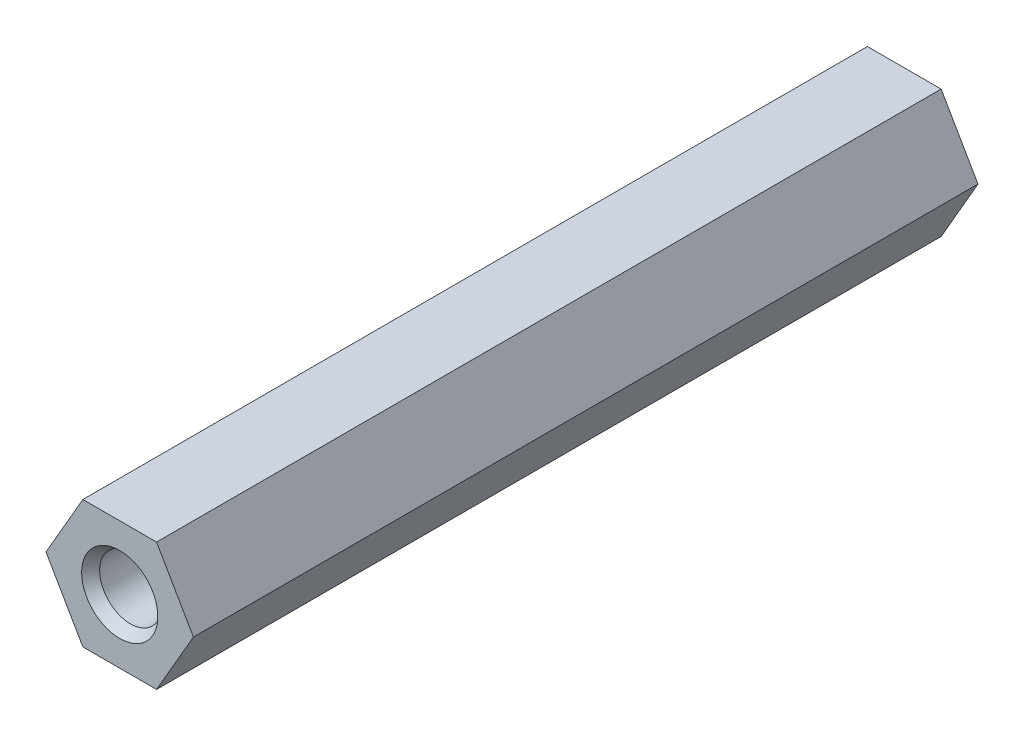
ISO-10303-21;
HEADER;
FILE_DESCRIPTION(('STEP AP214'),'2;1');
FILE_NAME('part.step','',(''),(''),'','','');
FILE_SCHEMA(('AUTOMOTIVE_DESIGN { 1 0 10303 214 1 1 1 1 }'));
ENDSEC;
DATA;
#1=APPLICATION_CONTEXT('core data for automotive mechanical design processes');
#2=APPLICATION_PROTOCOL_DEFINITION('international standard','automotive_design',2000,#1);
#3=PRODUCT_CONTEXT('',#1,'mechanical');
#4=PRODUCT('Part','Part','',(#3));
#5=PRODUCT_RELATED_PRODUCT_CATEGORY('part','',(#4));
#6=PRODUCT_DEFINITION_FORMATION('','',#4);
#7=PRODUCT_DEFINITION_CONTEXT('part definition',#1,'design');
#8=PRODUCT_DEFINITION('design','',#6,#7);
#9=PRODUCT_DEFINITION_SHAPE('','',#8);
#10=(LENGTH_UNIT() NAMED_UNIT(*) SI_UNIT(.MILLI.,.METRE.));
#11=(NAMED_UNIT(*) PLANE_ANGLE_UNIT() SI_UNIT($,.RADIAN.));
#12=(NAMED_UNIT(*) SI_UNIT($,.STERADIAN.) SOLID_ANGLE_UNIT());
#13=UNCERTAINTY_MEASURE_WITH_UNIT(LENGTH_MEASURE(1.E-05),#10,'distance_accuracy_value','');
#14=(GEOMETRIC_REPRESENTATION_CONTEXT(3) GLOBAL_UNCERTAINTY_ASSIGNED_CONTEXT((#13)) GLOBAL_UNIT_ASSIGNED_CONTEXT((#10,
#11,#12)) REPRESENTATION_CONTEXT('',''));
#15=CARTESIAN_POINT('',(0.,0.,0.));
#16=DIRECTION('',(0.,0.,1.));
#17=DIRECTION('',(1.,0.,0.));
#18=AXIS2_PLACEMENT_3D('',#15,#16,#17);
#19=CARTESIAN_POINT('',(-1.78978583448784,-3.1,-6.34999999995089));
#20=DIRECTION('',(0.,-1.,0.));
#21=DIRECTION('',(0.,0.,-1.));
#22=AXIS2_PLACEMENT_3D('',#19,#20,#21);
#23=PLANE('',#22);
#24=DIRECTION('',(0.,0.,1.));
#25=VECTOR('',#24,1.);
#26=CARTESIAN_POINT('',(-1.78978583448784,-3.1,-6.34999999995089));
#27=LINE('',#26,#25);
#28=CARTESIAN_POINT('',(-1.78978583448784,-3.1,-6.34999999995089));
#29=VERTEX_POINT('',#28);
#30=CARTESIAN_POINT('',(-1.78978583448784,-3.1,31.7500000000491));
#31=VERTEX_POINT('',#30);
#32=EDGE_CURVE('E87',#29,#31,#27,.T.);
#33=ORIENTED_EDGE('',*,*,#32,.F.);
#34=DIRECTION('',(1.,0.,0.));
#35=VECTOR('',#34,1.);
#36=CARTESIAN_POINT('',(0.,-3.1,-6.34999999995089));
#37=LINE('',#36,#35);
#38=CARTESIAN_POINT('',(1.78978583448784,-3.1,-6.34999999995089));
#39=VERTEX_POINT('',#38);
#40=EDGE_CURVE('E111',#29,#39,#37,.T.);
#41=ORIENTED_EDGE('',*,*,#40,.T.);
#42=DIRECTION('',(0.,0.,1.));
#43=VECTOR('',#42,1.);
#44=CARTESIAN_POINT('',(1.78978583448784,-3.1,-6.34999999995089));
#45=LINE('',#44,#43);
#46=CARTESIAN_POINT('',(1.78978583448784,-3.1,31.7500000000491));
#47=VERTEX_POINT('',#46);
#48=EDGE_CURVE('E185',#47,#39,#45,.F.);
#49=ORIENTED_EDGE('',*,*,#48,.F.);
#50=DIRECTION('',(1.,0.,0.));
#51=VECTOR('',#50,1.);
#52=CARTESIAN_POINT('',(0.,-3.1,31.7500000000491));
#53=LINE('',#52,#51);
#54=EDGE_CURVE('E109',#31,#47,#53,.T.);
#55=ORIENTED_EDGE('',*,*,#54,.F.);
#56=EDGE_LOOP('',(#33,#41,#49,#55));
#57=FACE_BOUND('',#56,.T.);
#58=ADVANCED_FACE('F38',(#57),#23,.T.);
#59=CARTESIAN_POINT('',(1.78978583448784,-3.1,-6.34999999995089));
#60=DIRECTION('',(0.866025403784439,-0.5,0.));
#61=DIRECTION('',(0.5,0.866025403784439,0.));
#62=AXIS2_PLACEMENT_3D('',#59,#60,#61);
#63=PLANE('',#62);
#64=ORIENTED_EDGE('',*,*,#48,.T.);
#65=DIRECTION('',(0.5,0.866025403784439,0.));
#66=VECTOR('',#65,1.);
#67=CARTESIAN_POINT('',(1.78978583448784,-3.1,-6.34999999995089));
#68=LINE('',#67,#66);
#69=CARTESIAN_POINT('',(3.57957166897568,0.,-6.34999999995089));
#70=VERTEX_POINT('',#69);
#71=EDGE_CURVE('E182',#39,#70,#68,.T.);
#72=ORIENTED_EDGE('',*,*,#71,.T.);
#73=DIRECTION('',(0.,0.,1.));
#74=VECTOR('',#73,1.);
#75=CARTESIAN_POINT('',(3.57957166897568,0.,-6.34999999995089));
#76=LINE('',#75,#74);
#77=CARTESIAN_POINT('',(3.57957166897568,0.,31.7500000000491));
#78=VERTEX_POINT('',#77);
#79=EDGE_CURVE('E179',#78,#70,#76,.F.);
#80=ORIENTED_EDGE('',*,*,#79,.F.);
#81=DIRECTION('',(0.5,0.866025403784439,0.));
#82=VECTOR('',#81,1.);
#83=CARTESIAN_POINT('',(1.78978583448784,-3.1,31.7500000000491));
#84=LINE('',#83,#82);
#85=EDGE_CURVE('E106',#47,#78,#84,.T.);
#86=ORIENTED_EDGE('',*,*,#85,.F.);
#87=EDGE_LOOP('',(#64,#72,#80,#86));
#88=FACE_BOUND('',#87,.T.);
#89=ADVANCED_FACE('F155',(#88),#63,.T.);
#90=CARTESIAN_POINT('',(3.57957166897568,0.,-6.34999999995089));
#91=DIRECTION('',(0.866025403784439,0.5,0.));
#92=DIRECTION('',(-0.5,0.866025403784439,0.));
#93=AXIS2_PLACEMENT_3D('',#90,#91,#92);
#94=PLANE('',#93);
#95=ORIENTED_EDGE('',*,*,#79,.T.);
#96=DIRECTION('',(-0.5,0.866025403784438,0.));
#97=VECTOR('',#96,1.);
#98=CARTESIAN_POINT('',(3.57957166897568,0.,-6.34999999995089));
#99=LINE('',#98,#97);
#100=CARTESIAN_POINT('',(1.78978583448784,3.1,-6.34999999995089));
#101=VERTEX_POINT('',#100);
#102=EDGE_CURVE('E170',#70,#101,#99,.T.);
#103=ORIENTED_EDGE('',*,*,#102,.T.);
#104=DIRECTION('',(0.,0.,1.));
#105=VECTOR('',#104,1.);
#106=CARTESIAN_POINT('',(1.78978583448784,3.1,-6.34999999995089));
#107=LINE('',#106,#105);
#108=CARTESIAN_POINT('',(1.78978583448784,3.1,31.7500000000491));
#109=VERTEX_POINT('',#108);
#110=EDGE_CURVE('E175',#109,#101,#107,.F.);
#111=ORIENTED_EDGE('',*,*,#110,.F.);
#112=DIRECTION('',(-0.5,0.866025403784438,0.));
#113=VECTOR('',#112,1.);
#114=CARTESIAN_POINT('',(3.57957166897568,0.,31.7500000000491));
#115=LINE('',#114,#113);
#116=EDGE_CURVE('E174',#78,#109,#115,.T.);
#117=ORIENTED_EDGE('',*,*,#116,.F.);
#118=EDGE_LOOP('',(#95,#103,#111,#117));
#119=FACE_BOUND('',#118,.T.);
#120=ADVANCED_FACE('F151',(#119),#94,.T.);
#121=CARTESIAN_POINT('',(1.78978583448784,3.1,-6.34999999995089));
#122=DIRECTION('',(0.,1.,0.));
#123=DIRECTION('',(0.,0.,1.));
#124=AXIS2_PLACEMENT_3D('',#121,#122,#123);
#125=PLANE('',#124);
#126=ORIENTED_EDGE('',*,*,#110,.T.);
#127=DIRECTION('',(1.,0.,0.));
#128=VECTOR('',#127,1.);
#129=CARTESIAN_POINT('',(0.,3.1,-6.34999999995089));
#130=LINE('',#129,#128);
#131=CARTESIAN_POINT('',(-1.78978583448784,3.1,-6.34999999995089));
#132=VERTEX_POINT('',#131);
#133=EDGE_CURVE('E167',#101,#132,#130,.F.);
#134=ORIENTED_EDGE('',*,*,#133,.T.);
#135=DIRECTION('',(0.,0.,1.));
#136=VECTOR('',#135,1.);
#137=CARTESIAN_POINT('',(-1.78978583448784,3.1,-6.34999999995089));
#138=LINE('',#137,#136);
#139=CARTESIAN_POINT('',(-1.78978583448784,3.1,31.7500000000491));
#140=VERTEX_POINT('',#139);
#141=EDGE_CURVE('E165',#140,#132,#138,.F.);
#142=ORIENTED_EDGE('',*,*,#141,.F.);
#143=DIRECTION('',(1.,0.,0.));
#144=VECTOR('',#143,1.);
#145=CARTESIAN_POINT('',(0.,3.1,31.7500000000491));
#146=LINE('',#145,#144);
#147=EDGE_CURVE('E98',#109,#140,#146,.F.);
#148=ORIENTED_EDGE('',*,*,#147,.F.);
#149=EDGE_LOOP('',(#126,#134,#142,#148));
#150=FACE_BOUND('',#149,.T.);
#151=ADVANCED_FACE('F148',(#150),#125,.T.);
#152=CARTESIAN_POINT('',(-1.78978583448784,3.1,-6.34999999995089));
#153=DIRECTION('',(-0.866025403784439,0.5,0.));
#154=DIRECTION('',(-0.5,-0.866025403784439,0.));
#155=AXIS2_PLACEMENT_3D('',#152,#153,#154);
#156=PLANE('',#155);
#157=ORIENTED_EDGE('',*,*,#141,.T.);
#158=DIRECTION('',(-0.5,-0.866025403784439,0.));
#159=VECTOR('',#158,1.);
#160=CARTESIAN_POINT('',(-1.78978583448784,3.1,-6.34999999995089));
#161=LINE('',#160,#159);
#162=CARTESIAN_POINT('',(-3.57957166897568,0.,-6.34999999995089));
#163=VERTEX_POINT('',#162);
#164=EDGE_CURVE('E105',#132,#163,#161,.T.);
#165=ORIENTED_EDGE('',*,*,#164,.T.);
#166=DIRECTION('',(0.,0.,1.));
#167=VECTOR('',#166,1.);
#168=CARTESIAN_POINT('',(-3.57957166897568,0.,-6.34999999995089));
#169=LINE('',#168,#167);
#170=CARTESIAN_POINT('',(-3.57957166897568,0.,31.7500000000491));
#171=VERTEX_POINT('',#170);
#172=EDGE_CURVE('E55',#171,#163,#169,.F.);
#173=ORIENTED_EDGE('',*,*,#172,.F.);
#174=DIRECTION('',(-0.5,-0.866025403784439,0.));
#175=VECTOR('',#174,1.);
#176=CARTESIAN_POINT('',(-1.78978583448784,3.1,31.7500000000491));
#177=LINE('',#176,#175);
#178=EDGE_CURVE('E92',#140,#171,#177,.T.);
#179=ORIENTED_EDGE('',*,*,#178,.F.);
#180=EDGE_LOOP('',(#157,#165,#173,#179));
#181=FACE_BOUND('',#180,.T.);
#182=ADVANCED_FACE('F103',(#181),#156,.T.);
#183=CARTESIAN_POINT('',(-3.57957166897568,0.,-6.34999999995089));
#184=DIRECTION('',(-0.866025403784438,-0.5,0.));
#185=DIRECTION('',(0.5,-0.866025403784438,0.));
#186=AXIS2_PLACEMENT_3D('',#183,#184,#185);
#187=PLANE('',#186);
#188=ORIENTED_EDGE('',*,*,#172,.T.);
#189=DIRECTION('',(0.5,-0.866025403784439,0.));
#190=VECTOR('',#189,1.);
#191=CARTESIAN_POINT('',(-3.57957166897568,0.,-6.34999999995089));
#192=LINE('',#191,#190);
#193=EDGE_CURVE('E115',#163,#29,#192,.T.);
#194=ORIENTED_EDGE('',*,*,#193,.T.);
#195=ORIENTED_EDGE('',*,*,#32,.T.);
#196=DIRECTION('',(0.5,-0.866025403784439,0.));
#197=VECTOR('',#196,1.);
#198=CARTESIAN_POINT('',(-3.57957166897568,0.,31.7500000000491));
#199=LINE('',#198,#197);
#200=EDGE_CURVE('E95',#171,#31,#199,.T.);
#201=ORIENTED_EDGE('',*,*,#200,.F.);
#202=EDGE_LOOP('',(#188,#194,#195,#201));
#203=FACE_BOUND('',#202,.T.);
#204=ADVANCED_FACE('F108',(#203),#187,.T.);
#205=CARTESIAN_POINT('',(0.,0.,31.7500000000491));
#206=DIRECTION('',(0.,0.,1.));
#207=DIRECTION('',(1.,0.,0.));
#208=AXIS2_PLACEMENT_3D('',#205,#206,#207);
#209=PLANE('',#208);
#210=CARTESIAN_POINT('',(0.,0.,31.7499999971359));
#211=DIRECTION('',(0.,0.,-1.));
#212=DIRECTION('',(-1.,0.,0.));
#213=AXIS2_PLACEMENT_3D('',#210,#211,#212);
#214=CIRCLE('',#213,1.84999999805768);
#215=CARTESIAN_POINT('',(-1.84999999805768,0.,31.7499999971359));
#216=VERTEX_POINT('',#215);
#217=EDGE_CURVE('E116',#216,#216,#214,.T.);
#218=ORIENTED_EDGE('',*,*,#217,.T.);
#219=EDGE_LOOP('',(#218));
#220=FACE_BOUND('',#219,.T.);
#221=ORIENTED_EDGE('',*,*,#200,.T.);
#222=ORIENTED_EDGE('',*,*,#54,.T.);
#223=ORIENTED_EDGE('',*,*,#85,.T.);
#224=ORIENTED_EDGE('',*,*,#116,.T.);
#225=ORIENTED_EDGE('',*,*,#147,.T.);
#226=ORIENTED_EDGE('',*,*,#178,.T.);
#227=EDGE_LOOP('',(#221,#222,#223,#224,#225,#226));
#228=FACE_BOUND('',#227,.T.);
#229=ADVANCED_FACE('F93',(#220,#228),#209,.T.);
#230=CARTESIAN_POINT('',(0.,0.,-6.34999999995089));
#231=DIRECTION('',(0.,0.,1.));
#232=DIRECTION('',(1.,0.,0.));
#233=AXIS2_PLACEMENT_3D('',#230,#231,#232);
#234=PLANE('',#233);
#235=CARTESIAN_POINT('',(0.,0.,-6.34999999568764));
#236=DIRECTION('',(0.,0.,1.));
#237=DIRECTION('',(0.,-1.,0.));
#238=AXIS2_PLACEMENT_3D('',#235,#236,#237);
#239=CIRCLE('',#238,1.84999999714819);
#240=CARTESIAN_POINT('',(0.,-1.84999999714819,-6.34999999568764));
#241=VERTEX_POINT('',#240);
#242=EDGE_CURVE('E42',#241,#241,#239,.T.);
#243=ORIENTED_EDGE('',*,*,#242,.T.);
#244=EDGE_LOOP('',(#243));
#245=FACE_BOUND('',#244,.T.);
#246=ORIENTED_EDGE('',*,*,#164,.F.);
#247=ORIENTED_EDGE('',*,*,#133,.F.);
#248=ORIENTED_EDGE('',*,*,#102,.F.);
#249=ORIENTED_EDGE('',*,*,#71,.F.);
#250=ORIENTED_EDGE('',*,*,#40,.F.);
#251=ORIENTED_EDGE('',*,*,#193,.F.);
#252=EDGE_LOOP('',(#246,#247,#248,#249,#250,#251));
#253=FACE_BOUND('',#252,.T.);
#254=ADVANCED_FACE('F125',(#245,#253),#234,.F.);
#255=CARTESIAN_POINT('',(0.,0.,31.7499999971359));
#256=DIRECTION('',(0.,0.,1.));
#257=DIRECTION('',(0.,-1.,0.));
#258=AXIS2_PLACEMENT_3D('',#255,#256,#257);
#259=CONICAL_SURFACE('',#258,1.84999999805768,0.58800260354757);
#260=CARTESIAN_POINT('',(0.,0.,31.2250000000491));
#261=DIRECTION('',(0.,0.,-1.));
#262=DIRECTION('',(0.,1.,0.));
#263=AXIS2_PLACEMENT_3D('',#260,#261,#262);
#264=CIRCLE('',#263,1.5);
#265=CARTESIAN_POINT('',(0.,1.5,31.2250000000491));
#266=VERTEX_POINT('',#265);
#267=EDGE_CURVE('E48',#266,#266,#264,.T.);
#268=ORIENTED_EDGE('',*,*,#267,.T.);
#269=EDGE_LOOP('',(#268));
#270=FACE_BOUND('',#269,.T.);
#271=ORIENTED_EDGE('',*,*,#217,.F.);
#272=EDGE_LOOP('',(#271));
#273=FACE_BOUND('',#272,.T.);
#274=ADVANCED_FACE('F130',(#270,#273),#259,.F.);
#275=CARTESIAN_POINT('',(0.,0.,-6.34999999568764));
#276=DIRECTION('',(0.,0.,-1.));
#277=DIRECTION('',(0.,1.,0.));
#278=AXIS2_PLACEMENT_3D('',#275,#276,#277);
#279=CONICAL_SURFACE('',#278,1.84999999714819,0.588002603547568);
#280=CARTESIAN_POINT('',(0.,0.,-5.82499999995088));
#281=DIRECTION('',(0.,0.,1.));
#282=DIRECTION('',(1.,0.,0.));
#283=AXIS2_PLACEMENT_3D('',#280,#281,#282);
#284=CIRCLE('',#283,1.5);
#285=CARTESIAN_POINT('',(1.5,0.,-5.82499999995088));
#286=VERTEX_POINT('',#285);
#287=EDGE_CURVE('E11',#286,#286,#284,.T.);
#288=ORIENTED_EDGE('',*,*,#287,.T.);
#289=EDGE_LOOP('',(#288));
#290=FACE_BOUND('',#289,.T.);
#291=ORIENTED_EDGE('',*,*,#242,.F.);
#292=EDGE_LOOP('',(#291));
#293=FACE_BOUND('',#292,.T.);
#294=ADVANCED_FACE('F128',(#290,#293),#279,.F.);
#295=CARTESIAN_POINT('',(0.,0.,31.7500000000491));
#296=DIRECTION('',(0.,0.,-1.));
#297=DIRECTION('',(-1.,0.,0.));
#298=AXIS2_PLACEMENT_3D('',#295,#296,#297);
#299=CYLINDRICAL_SURFACE('',#298,1.5);
#300=ORIENTED_EDGE('',*,*,#287,.F.);
#301=EDGE_LOOP('',(#300));
#302=FACE_BOUND('',#301,.T.);
#303=ORIENTED_EDGE('',*,*,#267,.F.);
#304=EDGE_LOOP('',(#303));
#305=FACE_BOUND('',#304,.T.);
#306=ADVANCED_FACE('F40',(#302,#305),#299,.F.);
#307=CLOSED_SHELL('',(#58,#89,#120,#151,#182,#204,#229,#254,#274,#294,#306));
#308=MANIFOLD_SOLID_BREP('B2',#307);
#309=ADVANCED_BREP_SHAPE_REPRESENTATION('',(#18,#308),#14);
#310=SHAPE_DEFINITION_REPRESENTATION(#9,#309);
ENDSEC;
END-ISO-10303-21;
